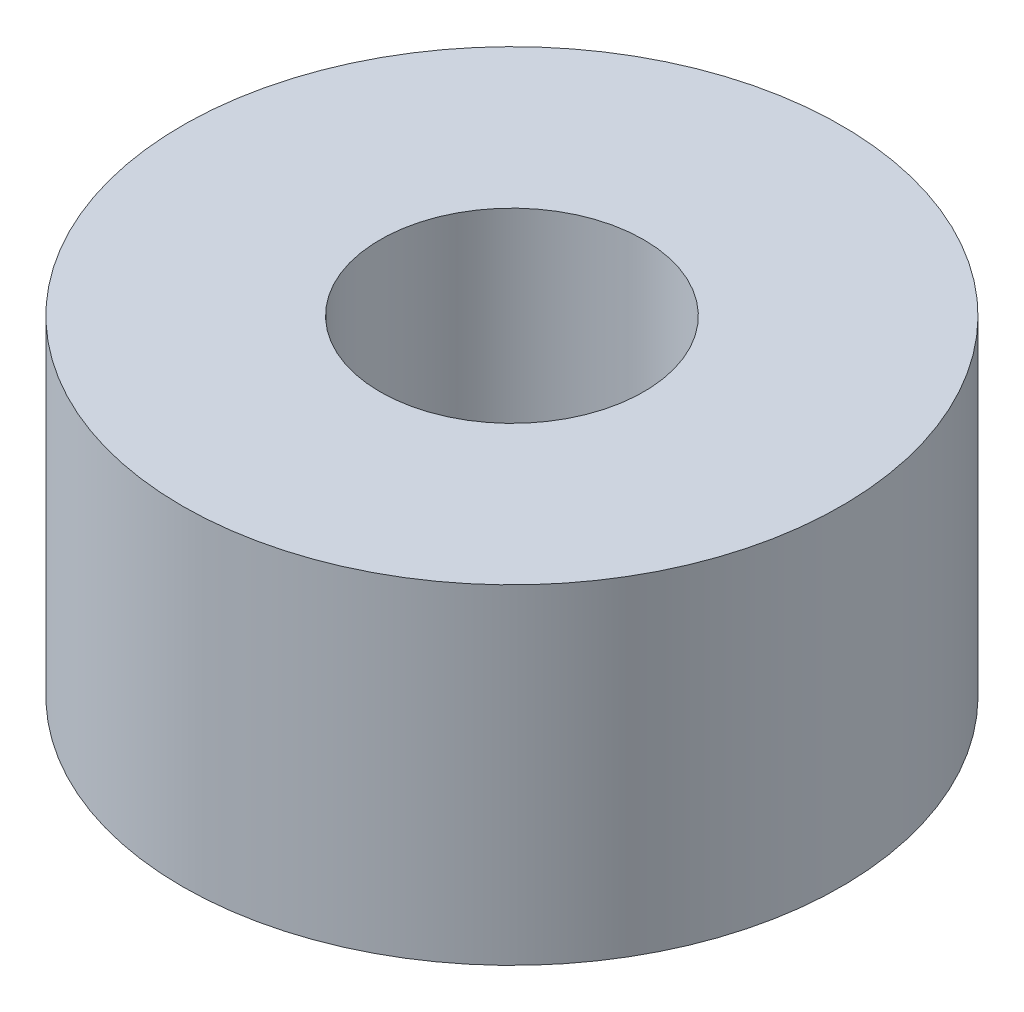
ISO-10303-21;
HEADER;
FILE_DESCRIPTION(('STEP AP214'),'2;1');
FILE_NAME('part.step','',(''),(''),'','','');
FILE_SCHEMA(('AUTOMOTIVE_DESIGN { 1 0 10303 214 1 1 1 1 }'));
ENDSEC;
DATA;
#1=APPLICATION_CONTEXT('core data for automotive mechanical design processes');
#2=APPLICATION_PROTOCOL_DEFINITION('international standard','automotive_design',2000,#1);
#3=PRODUCT_CONTEXT('',#1,'mechanical');
#4=PRODUCT('Part','Part','',(#3));
#5=PRODUCT_RELATED_PRODUCT_CATEGORY('part','',(#4));
#6=PRODUCT_DEFINITION_FORMATION('','',#4);
#7=PRODUCT_DEFINITION_CONTEXT('part definition',#1,'design');
#8=PRODUCT_DEFINITION('design','',#6,#7);
#9=PRODUCT_DEFINITION_SHAPE('','',#8);
#10=(LENGTH_UNIT() NAMED_UNIT(*) SI_UNIT(.MILLI.,.METRE.));
#11=(NAMED_UNIT(*) PLANE_ANGLE_UNIT() SI_UNIT($,.RADIAN.));
#12=(NAMED_UNIT(*) SI_UNIT($,.STERADIAN.) SOLID_ANGLE_UNIT());
#13=UNCERTAINTY_MEASURE_WITH_UNIT(LENGTH_MEASURE(1.E-05),#10,'distance_accuracy_value','');
#14=(GEOMETRIC_REPRESENTATION_CONTEXT(3) GLOBAL_UNCERTAINTY_ASSIGNED_CONTEXT((#13)) GLOBAL_UNIT_ASSIGNED_CONTEXT((#10,
#11,#12)) REPRESENTATION_CONTEXT('',''));
#15=CARTESIAN_POINT('',(0.,0.,0.));
#16=DIRECTION('',(0.,0.,1.));
#17=DIRECTION('',(1.,0.,0.));
#18=AXIS2_PLACEMENT_3D('',#15,#16,#17);
#19=CARTESIAN_POINT('',(0.,2.5,0.));
#20=DIRECTION('',(0.,1.,0.));
#21=DIRECTION('',(0.,0.,1.));
#22=AXIS2_PLACEMENT_3D('',#19,#20,#21);
#23=PLANE('',#22);
#24=CARTESIAN_POINT('',(0.,2.5,0.));
#25=DIRECTION('',(0.,1.,0.));
#26=DIRECTION('',(0.,0.,1.));
#27=AXIS2_PLACEMENT_3D('',#24,#25,#26);
#28=CIRCLE('',#27,2.5);
#29=CARTESIAN_POINT('',(0.,2.5,2.5));
#30=VERTEX_POINT('',#29);
#31=EDGE_CURVE('E10',#30,#30,#28,.T.);
#32=ORIENTED_EDGE('',*,*,#31,.T.);
#33=EDGE_LOOP('',(#32));
#34=FACE_BOUND('',#33,.T.);
#35=CARTESIAN_POINT('',(0.,2.5,0.));
#36=DIRECTION('',(0.,1.,0.));
#37=DIRECTION('',(0.,0.,1.));
#38=AXIS2_PLACEMENT_3D('',#35,#36,#37);
#39=CIRCLE('',#38,1.);
#40=CARTESIAN_POINT('',(0.,2.5,1.));
#41=VERTEX_POINT('',#40);
#42=EDGE_CURVE('E56',#41,#41,#39,.T.);
#43=ORIENTED_EDGE('',*,*,#42,.F.);
#44=EDGE_LOOP('',(#43));
#45=FACE_BOUND('',#44,.T.);
#46=ADVANCED_FACE('F43',(#34,#45),#23,.T.);
#47=CARTESIAN_POINT('',(0.,0.,0.));
#48=DIRECTION('',(0.,1.,0.));
#49=DIRECTION('',(0.,0.,1.));
#50=AXIS2_PLACEMENT_3D('',#47,#48,#49);
#51=PLANE('',#50);
#52=CARTESIAN_POINT('',(0.,0.,0.));
#53=DIRECTION('',(0.,1.,0.));
#54=DIRECTION('',(0.,0.,1.));
#55=AXIS2_PLACEMENT_3D('',#52,#53,#54);
#56=CIRCLE('',#55,2.5);
#57=CARTESIAN_POINT('',(0.,0.,2.5));
#58=VERTEX_POINT('',#57);
#59=EDGE_CURVE('E47',#58,#58,#56,.T.);
#60=ORIENTED_EDGE('',*,*,#59,.F.);
#61=EDGE_LOOP('',(#60));
#62=FACE_BOUND('',#61,.T.);
#63=CARTESIAN_POINT('',(0.,0.,0.));
#64=DIRECTION('',(0.,1.,0.));
#65=DIRECTION('',(0.,0.,1.));
#66=AXIS2_PLACEMENT_3D('',#63,#64,#65);
#67=CIRCLE('',#66,1.);
#68=CARTESIAN_POINT('',(0.,0.,1.));
#69=VERTEX_POINT('',#68);
#70=EDGE_CURVE('E58',#69,#69,#67,.T.);
#71=ORIENTED_EDGE('',*,*,#70,.T.);
#72=EDGE_LOOP('',(#71));
#73=FACE_BOUND('',#72,.T.);
#74=ADVANCED_FACE('F70',(#62,#73),#51,.F.);
#75=CARTESIAN_POINT('',(0.,2.5,0.));
#76=DIRECTION('',(0.,-1.,0.));
#77=DIRECTION('',(0.,0.,-1.));
#78=AXIS2_PLACEMENT_3D('',#75,#76,#77);
#79=CYLINDRICAL_SURFACE('',#78,2.5);
#80=ORIENTED_EDGE('',*,*,#31,.F.);
#81=EDGE_LOOP('',(#80));
#82=FACE_BOUND('',#81,.T.);
#83=ORIENTED_EDGE('',*,*,#59,.T.);
#84=EDGE_LOOP('',(#83));
#85=FACE_BOUND('',#84,.T.);
#86=ADVANCED_FACE('F45',(#82,#85),#79,.T.);
#87=CARTESIAN_POINT('',(0.,2.5,0.));
#88=DIRECTION('',(0.,-1.,0.));
#89=DIRECTION('',(0.,0.,-1.));
#90=AXIS2_PLACEMENT_3D('',#87,#88,#89);
#91=CYLINDRICAL_SURFACE('',#90,1.);
#92=ORIENTED_EDGE('',*,*,#42,.T.);
#93=EDGE_LOOP('',(#92));
#94=FACE_BOUND('',#93,.T.);
#95=ORIENTED_EDGE('',*,*,#70,.F.);
#96=EDGE_LOOP('',(#95));
#97=FACE_BOUND('',#96,.T.);
#98=ADVANCED_FACE('F66',(#94,#97),#91,.F.);
#99=CLOSED_SHELL('',(#46,#74,#86,#98));
#100=MANIFOLD_SOLID_BREP('B2',#99);
#101=ADVANCED_BREP_SHAPE_REPRESENTATION('',(#18,#100),#14);
#102=SHAPE_DEFINITION_REPRESENTATION(#9,#101);
ENDSEC;
END-ISO-10303-21;
